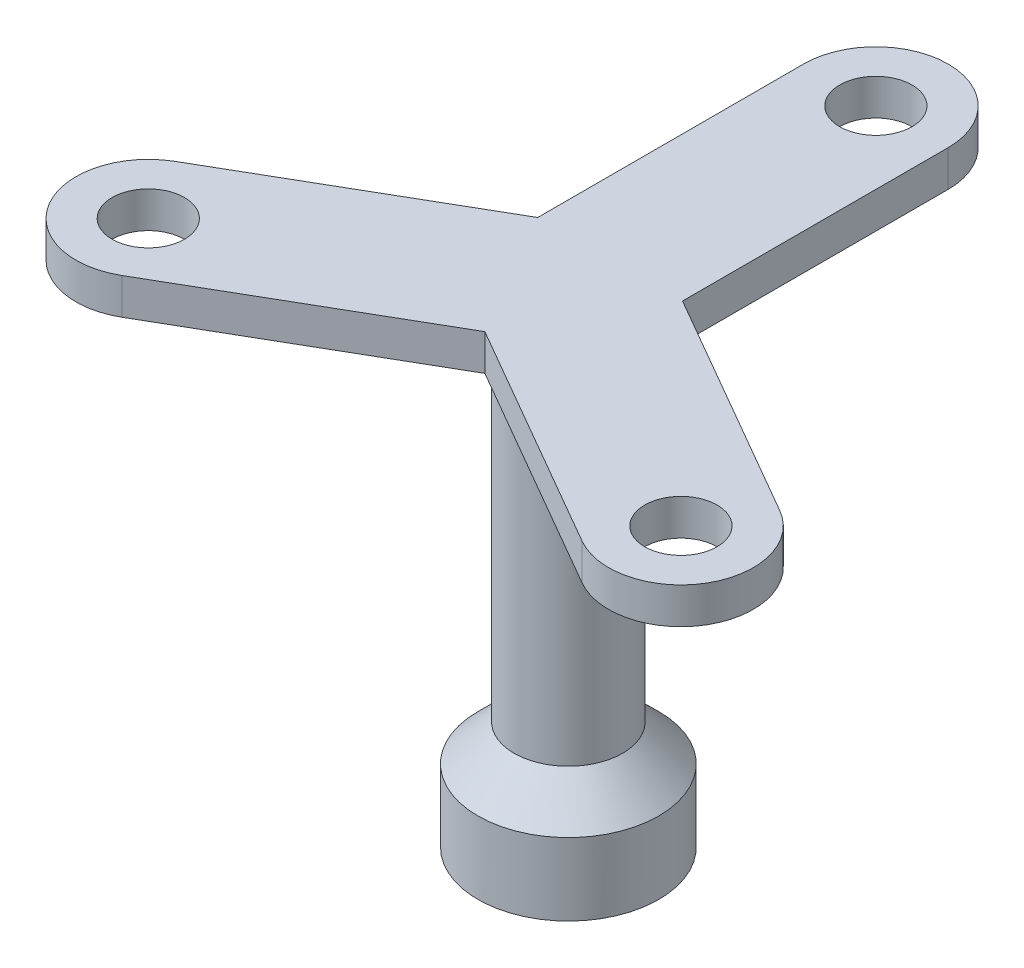
ISO-10303-21;
HEADER;
FILE_DESCRIPTION(('STEP AP214'),'2;1');
FILE_NAME('part.step','',(''),(''),'','','');
FILE_SCHEMA(('AUTOMOTIVE_DESIGN { 1 0 10303 214 1 1 1 1 }'));
ENDSEC;
DATA;
#1=APPLICATION_CONTEXT('core data for automotive mechanical design processes');
#2=APPLICATION_PROTOCOL_DEFINITION('international standard','automotive_design',2000,#1);
#3=PRODUCT_CONTEXT('',#1,'mechanical');
#4=PRODUCT('Part','Part','',(#3));
#5=PRODUCT_RELATED_PRODUCT_CATEGORY('part','',(#4));
#6=PRODUCT_DEFINITION_FORMATION('','',#4);
#7=PRODUCT_DEFINITION_CONTEXT('part definition',#1,'design');
#8=PRODUCT_DEFINITION('design','',#6,#7);
#9=PRODUCT_DEFINITION_SHAPE('','',#8);
#10=(LENGTH_UNIT() NAMED_UNIT(*) SI_UNIT(.MILLI.,.METRE.));
#11=(NAMED_UNIT(*) PLANE_ANGLE_UNIT() SI_UNIT($,.RADIAN.));
#12=(NAMED_UNIT(*) SI_UNIT($,.STERADIAN.) SOLID_ANGLE_UNIT());
#13=UNCERTAINTY_MEASURE_WITH_UNIT(LENGTH_MEASURE(1.E-05),#10,'distance_accuracy_value','');
#14=(GEOMETRIC_REPRESENTATION_CONTEXT(3) GLOBAL_UNCERTAINTY_ASSIGNED_CONTEXT((#13)) GLOBAL_UNIT_ASSIGNED_CONTEXT((#10,
#11,#12)) REPRESENTATION_CONTEXT('',''));
#15=CARTESIAN_POINT('',(0.,0.,0.));
#16=DIRECTION('',(0.,0.,1.));
#17=DIRECTION('',(1.,0.,0.));
#18=AXIS2_PLACEMENT_3D('',#15,#16,#17);
#19=CARTESIAN_POINT('',(0.,-6.99999999999999,0.));
#20=DIRECTION('',(0.,1.,0.));
#21=DIRECTION('',(-1.,0.,0.));
#22=AXIS2_PLACEMENT_3D('',#19,#20,#21);
#23=PLANE('',#22);
#24=CARTESIAN_POINT('',(0.,-7.,0.));
#25=DIRECTION('',(0.,1.,0.));
#26=DIRECTION('',(0.,0.,1.));
#27=AXIS2_PLACEMENT_3D('',#24,#25,#26);
#28=CIRCLE('',#27,3.);
#29=CARTESIAN_POINT('',(0.,-7.,3.));
#30=VERTEX_POINT('',#29);
#31=EDGE_CURVE('E46',#30,#30,#28,.T.);
#32=ORIENTED_EDGE('',*,*,#31,.T.);
#33=EDGE_LOOP('',(#32));
#34=FACE_BOUND('',#33,.T.);
#35=CARTESIAN_POINT('',(0.,-6.99999999999999,0.));
#36=DIRECTION('',(0.,1.,0.));
#37=DIRECTION('',(-1.,0.,0.));
#38=AXIS2_PLACEMENT_3D('',#35,#36,#37);
#39=CIRCLE('',#38,1.);
#40=CARTESIAN_POINT('',(-1.,-6.99999999999999,0.));
#41=VERTEX_POINT('',#40);
#42=EDGE_CURVE('E58',#41,#41,#39,.F.);
#43=ORIENTED_EDGE('',*,*,#42,.T.);
#44=EDGE_LOOP('',(#43));
#45=FACE_BOUND('',#44,.T.);
#46=ADVANCED_FACE('F42',(#34,#45),#23,.T.);
#47=CARTESIAN_POINT('',(0.,-13.,0.));
#48=DIRECTION('',(0.,-1.,0.));
#49=DIRECTION('',(0.,0.,-1.));
#50=AXIS2_PLACEMENT_3D('',#47,#48,#49);
#51=PLANE('',#50);
#52=CARTESIAN_POINT('',(0.,-13.,0.));
#53=DIRECTION('',(0.,-1.,0.));
#54=DIRECTION('',(0.,0.,-1.));
#55=AXIS2_PLACEMENT_3D('',#52,#53,#54);
#56=CIRCLE('',#55,5.);
#57=CARTESIAN_POINT('',(0.,-13.,-5.));
#58=VERTEX_POINT('',#57);
#59=EDGE_CURVE('E55',#58,#58,#56,.T.);
#60=ORIENTED_EDGE('',*,*,#59,.T.);
#61=EDGE_LOOP('',(#60));
#62=FACE_BOUND('',#61,.T.);
#63=CARTESIAN_POINT('',(0.,-13.,0.));
#64=DIRECTION('',(0.,-1.,0.));
#65=DIRECTION('',(0.,0.,-1.));
#66=AXIS2_PLACEMENT_3D('',#63,#64,#65);
#67=CIRCLE('',#66,2.5);
#68=CARTESIAN_POINT('',(0.,-13.,-2.5));
#69=VERTEX_POINT('',#68);
#70=EDGE_CURVE('E50',#69,#69,#67,.T.);
#71=ORIENTED_EDGE('',*,*,#70,.F.);
#72=EDGE_LOOP('',(#71));
#73=FACE_BOUND('',#72,.T.);
#74=ADVANCED_FACE('F83',(#62,#73),#51,.T.);
#75=CARTESIAN_POINT('',(0.,-9.,0.));
#76=DIRECTION('',(0.,-1.,0.));
#77=DIRECTION('',(0.,0.,-1.));
#78=AXIS2_PLACEMENT_3D('',#75,#76,#77);
#79=CYLINDRICAL_SURFACE('',#78,5.);
#80=CARTESIAN_POINT('',(0.,-9.,0.));
#81=DIRECTION('',(0.,1.,0.));
#82=DIRECTION('',(0.,0.,1.));
#83=AXIS2_PLACEMENT_3D('',#80,#81,#82);
#84=CIRCLE('',#83,5.);
#85=CARTESIAN_POINT('',(0.,-9.,5.));
#86=VERTEX_POINT('',#85);
#87=EDGE_CURVE('E64',#86,#86,#84,.T.);
#88=ORIENTED_EDGE('',*,*,#87,.F.);
#89=EDGE_LOOP('',(#88));
#90=FACE_BOUND('',#89,.T.);
#91=ORIENTED_EDGE('',*,*,#59,.F.);
#92=EDGE_LOOP('',(#91));
#93=FACE_BOUND('',#92,.T.);
#94=ADVANCED_FACE('F73',(#90,#93),#79,.T.);
#95=CARTESIAN_POINT('',(0.,-7.,0.));
#96=DIRECTION('',(0.,-1.,0.));
#97=DIRECTION('',(0.,0.,-1.));
#98=AXIS2_PLACEMENT_3D('',#95,#96,#97);
#99=CONICAL_SURFACE('',#98,3.,0.785398163397442);
#100=ORIENTED_EDGE('',*,*,#87,.T.);
#101=EDGE_LOOP('',(#100));
#102=FACE_BOUND('',#101,.T.);
#103=ORIENTED_EDGE('',*,*,#31,.F.);
#104=EDGE_LOOP('',(#103));
#105=FACE_BOUND('',#104,.T.);
#106=ADVANCED_FACE('F70',(#102,#105),#99,.T.);
#107=CARTESIAN_POINT('',(0.,-13.,0.));
#108=DIRECTION('',(0.,1.,0.));
#109=DIRECTION('',(0.,0.,1.));
#110=AXIS2_PLACEMENT_3D('',#107,#108,#109);
#111=CYLINDRICAL_SURFACE('',#110,2.5);
#112=ORIENTED_EDGE('',*,*,#70,.T.);
#113=EDGE_LOOP('',(#112));
#114=FACE_BOUND('',#113,.T.);
#115=CARTESIAN_POINT('',(0.,-10.,0.));
#116=DIRECTION('',(0.,-1.,0.));
#117=DIRECTION('',(0.,0.,-1.));
#118=AXIS2_PLACEMENT_3D('',#115,#116,#117);
#119=CIRCLE('',#118,2.5);
#120=CARTESIAN_POINT('',(0.,-10.,-2.5));
#121=VERTEX_POINT('',#120);
#122=EDGE_CURVE('E60',#121,#121,#119,.F.);
#123=ORIENTED_EDGE('',*,*,#122,.T.);
#124=EDGE_LOOP('',(#123));
#125=FACE_BOUND('',#124,.T.);
#126=ADVANCED_FACE('F72',(#114,#125),#111,.F.);
#127=CARTESIAN_POINT('',(0.,-10.,0.));
#128=DIRECTION('',(0.,-1.,0.));
#129=DIRECTION('',(0.,0.,-1.));
#130=AXIS2_PLACEMENT_3D('',#127,#128,#129);
#131=PLANE('',#130);
#132=CARTESIAN_POINT('',(0.,-10.,0.));
#133=DIRECTION('',(0.,-1.,0.));
#134=DIRECTION('',(0.,0.,-1.));
#135=AXIS2_PLACEMENT_3D('',#132,#133,#134);
#136=CIRCLE('',#135,1.);
#137=CARTESIAN_POINT('',(0.,-10.,-1.));
#138=VERTEX_POINT('',#137);
#139=EDGE_CURVE('E11',#138,#138,#136,.T.);
#140=ORIENTED_EDGE('',*,*,#139,.F.);
#141=EDGE_LOOP('',(#140));
#142=FACE_BOUND('',#141,.T.);
#143=ORIENTED_EDGE('',*,*,#122,.F.);
#144=EDGE_LOOP('',(#143));
#145=FACE_BOUND('',#144,.T.);
#146=ADVANCED_FACE('F80',(#142,#145),#131,.T.);
#147=CARTESIAN_POINT('',(0.,-2.,0.));
#148=DIRECTION('',(0.,-1.,0.));
#149=DIRECTION('',(0.,0.,-1.));
#150=AXIS2_PLACEMENT_3D('',#147,#148,#149);
#151=CYLINDRICAL_SURFACE('',#150,1.);
#152=ORIENTED_EDGE('',*,*,#139,.T.);
#153=EDGE_LOOP('',(#152));
#154=FACE_BOUND('',#153,.T.);
#155=ORIENTED_EDGE('',*,*,#42,.F.);
#156=EDGE_LOOP('',(#155));
#157=FACE_BOUND('',#156,.T.);
#158=ADVANCED_FACE('F44',(#154,#157),#151,.F.);
#159=CLOSED_SHELL('',(#46,#74,#94,#106,#126,#146,#158));
#160=MANIFOLD_SOLID_BREP('B2',#159);
#161=CARTESIAN_POINT('',(0.,-6.99999999999999,0.));
#162=DIRECTION('',(0.,1.,0.));
#163=DIRECTION('',(-1.,0.,0.));
#164=AXIS2_PLACEMENT_3D('',#161,#162,#163);
#165=PLANE('',#164);
#166=CARTESIAN_POINT('',(0.,-6.99999999999999,0.));
#167=DIRECTION('',(0.,1.,0.));
#168=DIRECTION('',(-1.,0.,0.));
#169=AXIS2_PLACEMENT_3D('',#166,#167,#168);
#170=CIRCLE('',#169,1.);
#171=CARTESIAN_POINT('',(-1.,-6.99999999999999,0.));
#172=VERTEX_POINT('',#171);
#173=EDGE_CURVE('E40',#172,#172,#170,.F.);
#174=ORIENTED_EDGE('',*,*,#173,.F.);
#175=EDGE_LOOP('',(#174));
#176=FACE_BOUND('',#175,.T.);
#177=CARTESIAN_POINT('',(0.,-7.,0.));
#178=DIRECTION('',(0.,1.,0.));
#179=DIRECTION('',(0.,0.,1.));
#180=AXIS2_PLACEMENT_3D('',#177,#178,#179);
#181=CIRCLE('',#180,3.);
#182=CARTESIAN_POINT('',(0.,-7.,3.));
#183=VERTEX_POINT('',#182);
#184=EDGE_CURVE('E162',#183,#183,#181,.T.);
#185=ORIENTED_EDGE('',*,*,#184,.F.);
#186=EDGE_LOOP('',(#185));
#187=FACE_BOUND('',#186,.T.);
#188=ADVANCED_FACE('F154',(#176,#187),#165,.F.);
#189=CARTESIAN_POINT('',(0.,-2.,0.));
#190=DIRECTION('',(0.,-1.,0.));
#191=DIRECTION('',(0.,0.,-1.));
#192=AXIS2_PLACEMENT_3D('',#189,#190,#191);
#193=PLANE('',#192);
#194=CARTESIAN_POINT('',(0.,-2.,0.));
#195=DIRECTION('',(0.,-1.,0.));
#196=DIRECTION('',(0.,0.,-1.));
#197=AXIS2_PLACEMENT_3D('',#194,#195,#196);
#198=CIRCLE('',#197,1.);
#199=CARTESIAN_POINT('',(0.,-2.,-1.));
#200=VERTEX_POINT('',#199);
#201=EDGE_CURVE('E270',#200,#200,#198,.T.);
#202=ORIENTED_EDGE('',*,*,#201,.T.);
#203=EDGE_LOOP('',(#202));
#204=FACE_BOUND('',#203,.T.);
#205=ADVANCED_FACE('F320',(#204),#193,.T.);
#206=CARTESIAN_POINT('',(0.,-2.,0.));
#207=DIRECTION('',(0.,-1.,0.));
#208=DIRECTION('',(0.,0.,-1.));
#209=AXIS2_PLACEMENT_3D('',#206,#207,#208);
#210=CYLINDRICAL_SURFACE('',#209,1.);
#211=ORIENTED_EDGE('',*,*,#173,.T.);
#212=EDGE_LOOP('',(#211));
#213=FACE_BOUND('',#212,.T.);
#214=ORIENTED_EDGE('',*,*,#201,.F.);
#215=EDGE_LOOP('',(#214));
#216=FACE_BOUND('',#215,.T.);
#217=ADVANCED_FACE('F325',(#213,#216),#210,.F.);
#218=CARTESIAN_POINT('',(-4.,14.,0.));
#219=DIRECTION('',(-1.,0.,0.));
#220=DIRECTION('',(0.,0.,1.));
#221=AXIS2_PLACEMENT_3D('',#218,#219,#220);
#222=PLANE('',#221);
#223=DIRECTION('',(0.,0.,-1.));
#224=VECTOR('',#223,1.);
#225=CARTESIAN_POINT('',(-4.,12.,0.));
#226=LINE('',#225,#224);
#227=CARTESIAN_POINT('',(-4.,12.,-2.30766902595093));
#228=VERTEX_POINT('',#227);
#229=CARTESIAN_POINT('',(-4.,12.,-17.));
#230=VERTEX_POINT('',#229);
#231=EDGE_CURVE('E266',#228,#230,#226,.T.);
#232=ORIENTED_EDGE('',*,*,#231,.F.);
#233=DIRECTION('',(0.,-1.,0.));
#234=VECTOR('',#233,1.);
#235=CARTESIAN_POINT('',(-4.,14.,-2.30766902595093));
#236=LINE('',#235,#234);
#237=CARTESIAN_POINT('',(-4.,14.,-2.30766902595093));
#238=VERTEX_POINT('',#237);
#239=EDGE_CURVE('E213',#238,#228,#236,.T.);
#240=ORIENTED_EDGE('',*,*,#239,.F.);
#241=DIRECTION('',(0.,0.,-1.));
#242=VECTOR('',#241,1.);
#243=CARTESIAN_POINT('',(-4.,14.,0.));
#244=LINE('',#243,#242);
#245=CARTESIAN_POINT('',(-4.,14.,-17.));
#246=VERTEX_POINT('',#245);
#247=EDGE_CURVE('E296',#238,#246,#244,.T.);
#248=ORIENTED_EDGE('',*,*,#247,.T.);
#249=DIRECTION('',(0.,-1.,0.));
#250=VECTOR('',#249,1.);
#251=CARTESIAN_POINT('',(-4.,14.,-17.));
#252=LINE('',#251,#250);
#253=EDGE_CURVE('E208',#246,#230,#252,.T.);
#254=ORIENTED_EDGE('',*,*,#253,.T.);
#255=EDGE_LOOP('',(#232,#240,#248,#254));
#256=FACE_BOUND('',#255,.T.);
#257=ADVANCED_FACE('F379',(#256),#222,.T.);
#258=CARTESIAN_POINT('',(-1.99925,14.,-3.46280257703208));
#259=DIRECTION('',(0.5,0.,0.866025403784439));
#260=DIRECTION('',(0.866025403784439,0.,-0.5));
#261=AXIS2_PLACEMENT_3D('',#258,#259,#260);
#262=PLANE('',#261);
#263=DIRECTION('',(-0.866025403784439,0.,0.5));
#264=VECTOR('',#263,1.);
#265=CARTESIAN_POINT('',(-1.99925,12.,-3.46280257703208));
#266=LINE('',#265,#264);
#267=CARTESIAN_POINT('',(-16.7209318643355,12.,5.03676441026603));
#268=VERTEX_POINT('',#267);
#269=EDGE_CURVE('E269',#228,#268,#266,.T.);
#270=ORIENTED_EDGE('',*,*,#269,.T.);
#271=DIRECTION('',(0.,-1.,0.));
#272=VECTOR('',#271,1.);
#273=CARTESIAN_POINT('',(-16.7209318643355,14.,5.03676441026603));
#274=LINE('',#273,#272);
#275=CARTESIAN_POINT('',(-16.7209318643355,14.,5.03676441026603));
#276=VERTEX_POINT('',#275);
#277=EDGE_CURVE('E307',#276,#268,#274,.T.);
#278=ORIENTED_EDGE('',*,*,#277,.F.);
#279=DIRECTION('',(-0.866025403784439,0.,0.5));
#280=VECTOR('',#279,1.);
#281=CARTESIAN_POINT('',(-1.99925,14.,-3.46280257703208));
#282=LINE('',#281,#280);
#283=EDGE_CURVE('E398',#238,#276,#282,.T.);
#284=ORIENTED_EDGE('',*,*,#283,.F.);
#285=ORIENTED_EDGE('',*,*,#239,.T.);
#286=EDGE_LOOP('',(#270,#278,#284,#285));
#287=FACE_BOUND('',#286,.T.);
#288=ADVANCED_FACE('F376',(#287),#262,.F.);
#289=CARTESIAN_POINT('',(-14.7209318643355,14.,8.50086602540365));
#290=DIRECTION('',(0.,-1.,0.));
#291=DIRECTION('',(0.,0.,-1.));
#292=AXIS2_PLACEMENT_3D('',#289,#290,#291);
#293=CYLINDRICAL_SURFACE('',#292,4.);
#294=CARTESIAN_POINT('',(-14.7209318643355,12.,8.50086602540365));
#295=DIRECTION('',(0.,1.,0.));
#296=DIRECTION('',(0.,0.,1.));
#297=AXIS2_PLACEMENT_3D('',#294,#295,#296);
#298=CIRCLE('',#297,4.);
#299=CARTESIAN_POINT('',(-12.7209318643355,12.,11.9649676405415));
#300=VERTEX_POINT('',#299);
#301=EDGE_CURVE('E272',#268,#300,#298,.T.);
#302=ORIENTED_EDGE('',*,*,#301,.T.);
#303=DIRECTION('',(0.,-1.,0.));
#304=VECTOR('',#303,1.);
#305=CARTESIAN_POINT('',(-12.7209318643355,14.,11.9649676405415));
#306=LINE('',#305,#304);
#307=CARTESIAN_POINT('',(-12.7209318643355,14.,11.9649676405415));
#308=VERTEX_POINT('',#307);
#309=EDGE_CURVE('E305',#308,#300,#306,.T.);
#310=ORIENTED_EDGE('',*,*,#309,.F.);
#311=CARTESIAN_POINT('',(-14.7209318643355,14.,8.50086602540365));
#312=DIRECTION('',(0.,1.,0.));
#313=DIRECTION('',(0.,0.,1.));
#314=AXIS2_PLACEMENT_3D('',#311,#312,#313);
#315=CIRCLE('',#314,4.);
#316=EDGE_CURVE('E394',#276,#308,#315,.T.);
#317=ORIENTED_EDGE('',*,*,#316,.F.);
#318=ORIENTED_EDGE('',*,*,#277,.T.);
#319=EDGE_LOOP('',(#302,#310,#317,#318));
#320=FACE_BOUND('',#319,.T.);
#321=ADVANCED_FACE('F372',(#320),#293,.T.);
#322=CARTESIAN_POINT('',(2.00075,14.,3.46540065324343));
#323=DIRECTION('',(0.5,0.,0.866025403784439));
#324=DIRECTION('',(0.866025403784439,0.,-0.5));
#325=AXIS2_PLACEMENT_3D('',#322,#323,#324);
#326=PLANE('',#325);
#327=DIRECTION('',(-0.866025403784439,0.,0.5));
#328=VECTOR('',#327,1.);
#329=CARTESIAN_POINT('',(2.00075,12.,3.46540065324343));
#330=LINE('',#329,#328);
#331=CARTESIAN_POINT('',(0.00299999999999736,12.,4.618802153517));
#332=VERTEX_POINT('',#331);
#333=EDGE_CURVE('E275',#332,#300,#330,.T.);
#334=ORIENTED_EDGE('',*,*,#333,.F.);
#335=DIRECTION('',(0.,-1.,0.));
#336=VECTOR('',#335,1.);
#337=CARTESIAN_POINT('',(0.00299999999999736,14.,4.618802153517));
#338=LINE('',#337,#336);
#339=CARTESIAN_POINT('',(0.00299999999999736,14.,4.618802153517));
#340=VERTEX_POINT('',#339);
#341=EDGE_CURVE('E303',#340,#332,#338,.T.);
#342=ORIENTED_EDGE('',*,*,#341,.F.);
#343=DIRECTION('',(-0.866025403784439,0.,0.5));
#344=VECTOR('',#343,1.);
#345=CARTESIAN_POINT('',(2.00075,14.,3.46540065324343));
#346=LINE('',#345,#344);
#347=EDGE_CURVE('E397',#340,#308,#346,.T.);
#348=ORIENTED_EDGE('',*,*,#347,.T.);
#349=ORIENTED_EDGE('',*,*,#309,.T.);
#350=EDGE_LOOP('',(#334,#342,#348,#349));
#351=FACE_BOUND('',#350,.T.);
#352=ADVANCED_FACE('F368',(#351),#326,.T.);
#353=CARTESIAN_POINT('',(-1.99925,14.,3.46280257703208));
#354=DIRECTION('',(0.5,0.,-0.866025403784439));
#355=DIRECTION('',(-0.866025403784439,0.,-0.5));
#356=AXIS2_PLACEMENT_3D('',#353,#354,#355);
#357=PLANE('',#356);
#358=DIRECTION('',(0.866025403784439,0.,0.5));
#359=VECTOR('',#358,1.);
#360=CARTESIAN_POINT('',(-1.99925,12.,3.46280257703208));
#361=LINE('',#360,#359);
#362=CARTESIAN_POINT('',(12.7239318643355,12.,11.963235589734));
#363=VERTEX_POINT('',#362);
#364=EDGE_CURVE('E278',#332,#363,#361,.T.);
#365=ORIENTED_EDGE('',*,*,#364,.T.);
#366=DIRECTION('',(0.,-1.,0.));
#367=VECTOR('',#366,1.);
#368=CARTESIAN_POINT('',(12.7239318643355,14.,11.963235589734));
#369=LINE('',#368,#367);
#370=CARTESIAN_POINT('',(12.7239318643355,14.,11.963235589734));
#371=VERTEX_POINT('',#370);
#372=EDGE_CURVE('E300',#371,#363,#369,.T.);
#373=ORIENTED_EDGE('',*,*,#372,.F.);
#374=DIRECTION('',(0.866025403784439,0.,0.5));
#375=VECTOR('',#374,1.);
#376=CARTESIAN_POINT('',(-1.99925,14.,3.46280257703208));
#377=LINE('',#376,#375);
#378=EDGE_CURVE('E252',#340,#371,#377,.T.);
#379=ORIENTED_EDGE('',*,*,#378,.F.);
#380=ORIENTED_EDGE('',*,*,#341,.T.);
#381=EDGE_LOOP('',(#365,#373,#379,#380));
#382=FACE_BOUND('',#381,.T.);
#383=ADVANCED_FACE('F364',(#382),#357,.F.);
#384=CARTESIAN_POINT('',(14.7239318643354,14.,8.49913397459629));
#385=DIRECTION('',(0.,-1.,0.));
#386=DIRECTION('',(0.,0.,-1.));
#387=AXIS2_PLACEMENT_3D('',#384,#385,#386);
#388=CYLINDRICAL_SURFACE('',#387,4.);
#389=CARTESIAN_POINT('',(14.7239318643354,12.,8.49913397459629));
#390=DIRECTION('',(0.,1.,0.));
#391=DIRECTION('',(0.,0.,1.));
#392=AXIS2_PLACEMENT_3D('',#389,#390,#391);
#393=CIRCLE('',#392,4.);
#394=CARTESIAN_POINT('',(16.7239318643355,12.,5.03503235945846));
#395=VERTEX_POINT('',#394);
#396=EDGE_CURVE('E280',#363,#395,#393,.T.);
#397=ORIENTED_EDGE('',*,*,#396,.T.);
#398=DIRECTION('',(0.,-1.,0.));
#399=VECTOR('',#398,1.);
#400=CARTESIAN_POINT('',(16.7239318643355,14.,5.03503235945846));
#401=LINE('',#400,#399);
#402=CARTESIAN_POINT('',(16.7239318643355,14.,5.03503235945846));
#403=VERTEX_POINT('',#402);
#404=EDGE_CURVE('E240',#403,#395,#401,.T.);
#405=ORIENTED_EDGE('',*,*,#404,.F.);
#406=CARTESIAN_POINT('',(14.7239318643354,14.,8.49913397459629));
#407=DIRECTION('',(0.,1.,0.));
#408=DIRECTION('',(0.,0.,1.));
#409=AXIS2_PLACEMENT_3D('',#406,#407,#408);
#410=CIRCLE('',#409,4.);
#411=EDGE_CURVE('E249',#371,#403,#410,.T.);
#412=ORIENTED_EDGE('',*,*,#411,.F.);
#413=ORIENTED_EDGE('',*,*,#372,.T.);
#414=EDGE_LOOP('',(#397,#405,#412,#413));
#415=FACE_BOUND('',#414,.T.);
#416=ADVANCED_FACE('F361',(#415),#388,.T.);
#417=CARTESIAN_POINT('',(2.00075,14.,-3.46540065324343));
#418=DIRECTION('',(0.5,0.,-0.866025403784439));
#419=DIRECTION('',(-0.866025403784439,0.,-0.5));
#420=AXIS2_PLACEMENT_3D('',#417,#418,#419);
#421=PLANE('',#420);
#422=DIRECTION('',(0.866025403784439,0.,0.5));
#423=VECTOR('',#422,1.);
#424=CARTESIAN_POINT('',(2.00075,12.,-3.46540065324343));
#425=LINE('',#424,#423);
#426=CARTESIAN_POINT('',(4.,12.,-2.31113312756607));
#427=VERTEX_POINT('',#426);
#428=EDGE_CURVE('E239',#427,#395,#425,.T.);
#429=ORIENTED_EDGE('',*,*,#428,.F.);
#430=DIRECTION('',(0.,-1.,0.));
#431=VECTOR('',#430,1.);
#432=CARTESIAN_POINT('',(4.,14.,-2.31113312756607));
#433=LINE('',#432,#431);
#434=CARTESIAN_POINT('',(4.,14.,-2.31113312756607));
#435=VERTEX_POINT('',#434);
#436=EDGE_CURVE('E233',#435,#427,#433,.T.);
#437=ORIENTED_EDGE('',*,*,#436,.F.);
#438=DIRECTION('',(0.866025403784439,0.,0.5));
#439=VECTOR('',#438,1.);
#440=CARTESIAN_POINT('',(2.00075,14.,-3.46540065324343));
#441=LINE('',#440,#439);
#442=EDGE_CURVE('E237',#435,#403,#441,.T.);
#443=ORIENTED_EDGE('',*,*,#442,.T.);
#444=ORIENTED_EDGE('',*,*,#404,.T.);
#445=EDGE_LOOP('',(#429,#437,#443,#444));
#446=FACE_BOUND('',#445,.T.);
#447=ADVANCED_FACE('F235',(#446),#421,.T.);
#448=CARTESIAN_POINT('',(4.,14.,0.));
#449=DIRECTION('',(-1.,0.,0.));
#450=DIRECTION('',(0.,0.,1.));
#451=AXIS2_PLACEMENT_3D('',#448,#449,#450);
#452=PLANE('',#451);
#453=DIRECTION('',(0.,0.,-1.));
#454=VECTOR('',#453,1.);
#455=CARTESIAN_POINT('',(4.,12.,0.));
#456=LINE('',#455,#454);
#457=CARTESIAN_POINT('',(4.,12.,-17.));
#458=VERTEX_POINT('',#457);
#459=EDGE_CURVE('E201',#427,#458,#456,.T.);
#460=ORIENTED_EDGE('',*,*,#459,.T.);
#461=DIRECTION('',(0.,-1.,0.));
#462=VECTOR('',#461,1.);
#463=CARTESIAN_POINT('',(4.,14.,-17.));
#464=LINE('',#463,#462);
#465=CARTESIAN_POINT('',(4.,14.,-17.));
#466=VERTEX_POINT('',#465);
#467=EDGE_CURVE('E241',#466,#458,#464,.T.);
#468=ORIENTED_EDGE('',*,*,#467,.F.);
#469=DIRECTION('',(0.,0.,-1.));
#470=VECTOR('',#469,1.);
#471=CARTESIAN_POINT('',(4.,14.,0.));
#472=LINE('',#471,#470);
#473=EDGE_CURVE('E243',#435,#466,#472,.T.);
#474=ORIENTED_EDGE('',*,*,#473,.F.);
#475=ORIENTED_EDGE('',*,*,#436,.T.);
#476=EDGE_LOOP('',(#460,#468,#474,#475));
#477=FACE_BOUND('',#476,.T.);
#478=ADVANCED_FACE('F244',(#477),#452,.F.);
#479=CARTESIAN_POINT('',(14.7224318643354,14.,8.50000000000007));
#480=DIRECTION('',(0.,-1.,0.));
#481=DIRECTION('',(0.,0.,-1.));
#482=AXIS2_PLACEMENT_3D('',#479,#480,#481);
#483=CYLINDRICAL_SURFACE('',#482,2.00000000000001);
#484=CARTESIAN_POINT('',(14.7224318643354,14.,8.50000000000007));
#485=DIRECTION('',(0.,1.,0.));
#486=DIRECTION('',(0.,0.,1.));
#487=AXIS2_PLACEMENT_3D('',#484,#485,#486);
#488=CIRCLE('',#487,2.00000000000001);
#489=CARTESIAN_POINT('',(14.7224318643354,14.,10.5000000000001));
#490=VERTEX_POINT('',#489);
#491=EDGE_CURVE('E260',#490,#490,#488,.T.);
#492=ORIENTED_EDGE('',*,*,#491,.T.);
#493=EDGE_LOOP('',(#492));
#494=FACE_BOUND('',#493,.T.);
#495=CARTESIAN_POINT('',(14.7224318643354,12.,8.50000000000007));
#496=DIRECTION('',(0.,1.,0.));
#497=DIRECTION('',(0.,0.,1.));
#498=AXIS2_PLACEMENT_3D('',#495,#496,#497);
#499=CIRCLE('',#498,2.00000000000001);
#500=CARTESIAN_POINT('',(14.7224318643354,12.,10.5000000000001));
#501=VERTEX_POINT('',#500);
#502=EDGE_CURVE('E290',#501,#501,#499,.T.);
#503=ORIENTED_EDGE('',*,*,#502,.F.);
#504=EDGE_LOOP('',(#503));
#505=FACE_BOUND('',#504,.T.);
#506=ADVANCED_FACE('F346',(#494,#505),#483,.F.);
#507=CARTESIAN_POINT('',(0.,14.,-17.));
#508=DIRECTION('',(0.,-1.,0.));
#509=DIRECTION('',(0.,0.,-1.));
#510=AXIS2_PLACEMENT_3D('',#507,#508,#509);
#511=CYLINDRICAL_SURFACE('',#510,2.);
#512=CARTESIAN_POINT('',(0.,14.,-17.));
#513=DIRECTION('',(0.,1.,0.));
#514=DIRECTION('',(0.,0.,1.));
#515=AXIS2_PLACEMENT_3D('',#512,#513,#514);
#516=CIRCLE('',#515,2.);
#517=CARTESIAN_POINT('',(0.,14.,-15.));
#518=VERTEX_POINT('',#517);
#519=EDGE_CURVE('E257',#518,#518,#516,.T.);
#520=ORIENTED_EDGE('',*,*,#519,.T.);
#521=EDGE_LOOP('',(#520));
#522=FACE_BOUND('',#521,.T.);
#523=CARTESIAN_POINT('',(0.,12.,-17.));
#524=DIRECTION('',(0.,1.,0.));
#525=DIRECTION('',(0.,0.,1.));
#526=AXIS2_PLACEMENT_3D('',#523,#524,#525);
#527=CIRCLE('',#526,2.);
#528=CARTESIAN_POINT('',(0.,12.,-15.));
#529=VERTEX_POINT('',#528);
#530=EDGE_CURVE('E287',#529,#529,#527,.T.);
#531=ORIENTED_EDGE('',*,*,#530,.F.);
#532=EDGE_LOOP('',(#531));
#533=FACE_BOUND('',#532,.T.);
#534=ADVANCED_FACE('F349',(#522,#533),#511,.F.);
#535=CARTESIAN_POINT('',(0.,14.,-17.));
#536=DIRECTION('',(0.,-1.,0.));
#537=DIRECTION('',(0.,0.,-1.));
#538=AXIS2_PLACEMENT_3D('',#535,#536,#537);
#539=CYLINDRICAL_SURFACE('',#538,4.);
#540=CARTESIAN_POINT('',(0.,12.,-17.));
#541=DIRECTION('',(0.,1.,0.));
#542=DIRECTION('',(0.,0.,1.));
#543=AXIS2_PLACEMENT_3D('',#540,#541,#542);
#544=CIRCLE('',#543,4.);
#545=EDGE_CURVE('E285',#458,#230,#544,.T.);
#546=ORIENTED_EDGE('',*,*,#545,.T.);
#547=ORIENTED_EDGE('',*,*,#253,.F.);
#548=CARTESIAN_POINT('',(0.,14.,-17.));
#549=DIRECTION('',(0.,1.,0.));
#550=DIRECTION('',(0.,0.,1.));
#551=AXIS2_PLACEMENT_3D('',#548,#549,#550);
#552=CIRCLE('',#551,4.);
#553=EDGE_CURVE('E170',#466,#246,#552,.T.);
#554=ORIENTED_EDGE('',*,*,#553,.F.);
#555=ORIENTED_EDGE('',*,*,#467,.T.);
#556=EDGE_LOOP('',(#546,#547,#554,#555));
#557=FACE_BOUND('',#556,.T.);
#558=ADVANCED_FACE('F344',(#557),#539,.T.);
#559=CARTESIAN_POINT('',(-14.7224318643354,14.,8.50000000000007));
#560=DIRECTION('',(0.,-1.,0.));
#561=DIRECTION('',(0.,0.,-1.));
#562=AXIS2_PLACEMENT_3D('',#559,#560,#561);
#563=CYLINDRICAL_SURFACE('',#562,2.);
#564=CARTESIAN_POINT('',(-14.7224318643354,14.,8.50000000000007));
#565=DIRECTION('',(0.,1.,0.));
#566=DIRECTION('',(0.,0.,1.));
#567=AXIS2_PLACEMENT_3D('',#564,#565,#566);
#568=CIRCLE('',#567,2.);
#569=CARTESIAN_POINT('',(-14.7224318643354,14.,10.5000000000001));
#570=VERTEX_POINT('',#569);
#571=EDGE_CURVE('E263',#570,#570,#568,.T.);
#572=ORIENTED_EDGE('',*,*,#571,.T.);
#573=EDGE_LOOP('',(#572));
#574=FACE_BOUND('',#573,.T.);
#575=CARTESIAN_POINT('',(-14.7224318643354,12.,8.50000000000007));
#576=DIRECTION('',(0.,1.,0.));
#577=DIRECTION('',(0.,0.,1.));
#578=AXIS2_PLACEMENT_3D('',#575,#576,#577);
#579=CIRCLE('',#578,2.);
#580=CARTESIAN_POINT('',(-14.7224318643354,12.,10.5000000000001));
#581=VERTEX_POINT('',#580);
#582=EDGE_CURVE('E293',#581,#581,#579,.T.);
#583=ORIENTED_EDGE('',*,*,#582,.F.);
#584=EDGE_LOOP('',(#583));
#585=FACE_BOUND('',#584,.T.);
#586=ADVANCED_FACE('F340',(#574,#585),#563,.F.);
#587=CARTESIAN_POINT('',(0.,14.,0.));
#588=DIRECTION('',(0.,1.,0.));
#589=DIRECTION('',(0.,0.,1.));
#590=AXIS2_PLACEMENT_3D('',#587,#588,#589);
#591=PLANE('',#590);
#592=ORIENTED_EDGE('',*,*,#247,.F.);
#593=ORIENTED_EDGE('',*,*,#283,.T.);
#594=ORIENTED_EDGE('',*,*,#316,.T.);
#595=ORIENTED_EDGE('',*,*,#347,.F.);
#596=ORIENTED_EDGE('',*,*,#378,.T.);
#597=ORIENTED_EDGE('',*,*,#411,.T.);
#598=ORIENTED_EDGE('',*,*,#442,.F.);
#599=ORIENTED_EDGE('',*,*,#473,.T.);
#600=ORIENTED_EDGE('',*,*,#553,.T.);
#601=EDGE_LOOP('',(#592,#593,#594,#595,#596,#597,#598,#599,#600));
#602=FACE_BOUND('',#601,.T.);
#603=ORIENTED_EDGE('',*,*,#519,.F.);
#604=EDGE_LOOP('',(#603));
#605=FACE_BOUND('',#604,.T.);
#606=ORIENTED_EDGE('',*,*,#491,.F.);
#607=EDGE_LOOP('',(#606));
#608=FACE_BOUND('',#607,.T.);
#609=ORIENTED_EDGE('',*,*,#571,.F.);
#610=EDGE_LOOP('',(#609));
#611=FACE_BOUND('',#610,.T.);
#612=ADVANCED_FACE('F246',(#602,#605,#608,#611),#591,.T.);
#613=CARTESIAN_POINT('',(0.,12.,0.));
#614=DIRECTION('',(0.,1.,0.));
#615=DIRECTION('',(0.,0.,1.));
#616=AXIS2_PLACEMENT_3D('',#613,#614,#615);
#617=PLANE('',#616);
#618=CARTESIAN_POINT('',(0.,12.,0.));
#619=DIRECTION('',(0.,1.,0.));
#620=DIRECTION('',(0.,0.,1.));
#621=AXIS2_PLACEMENT_3D('',#618,#619,#620);
#622=CIRCLE('',#621,3.);
#623=CARTESIAN_POINT('',(0.,12.,3.));
#624=VERTEX_POINT('',#623);
#625=EDGE_CURVE('E311',#624,#624,#622,.F.);
#626=ORIENTED_EDGE('',*,*,#625,.F.);
#627=EDGE_LOOP('',(#626));
#628=FACE_BOUND('',#627,.T.);
#629=ORIENTED_EDGE('',*,*,#231,.T.);
#630=ORIENTED_EDGE('',*,*,#545,.F.);
#631=ORIENTED_EDGE('',*,*,#459,.F.);
#632=ORIENTED_EDGE('',*,*,#428,.T.);
#633=ORIENTED_EDGE('',*,*,#396,.F.);
#634=ORIENTED_EDGE('',*,*,#364,.F.);
#635=ORIENTED_EDGE('',*,*,#333,.T.);
#636=ORIENTED_EDGE('',*,*,#301,.F.);
#637=ORIENTED_EDGE('',*,*,#269,.F.);
#638=EDGE_LOOP('',(#629,#630,#631,#632,#633,#634,#635,#636,#637));
#639=FACE_BOUND('',#638,.T.);
#640=ORIENTED_EDGE('',*,*,#530,.T.);
#641=EDGE_LOOP('',(#640));
#642=FACE_BOUND('',#641,.T.);
#643=ORIENTED_EDGE('',*,*,#502,.T.);
#644=EDGE_LOOP('',(#643));
#645=FACE_BOUND('',#644,.T.);
#646=ORIENTED_EDGE('',*,*,#582,.T.);
#647=EDGE_LOOP('',(#646));
#648=FACE_BOUND('',#647,.T.);
#649=ADVANCED_FACE('F330',(#628,#639,#642,#645,#648),#617,.F.);
#650=CARTESIAN_POINT('',(0.,-10.,0.));
#651=DIRECTION('',(0.,1.,0.));
#652=DIRECTION('',(0.,0.,1.));
#653=AXIS2_PLACEMENT_3D('',#650,#651,#652);
#654=CYLINDRICAL_SURFACE('',#653,3.);
#655=ORIENTED_EDGE('',*,*,#184,.T.);
#656=EDGE_LOOP('',(#655));
#657=FACE_BOUND('',#656,.T.);
#658=ORIENTED_EDGE('',*,*,#625,.T.);
#659=EDGE_LOOP('',(#658));
#660=FACE_BOUND('',#659,.T.);
#661=ADVANCED_FACE('F316',(#657,#660),#654,.T.);
#662=CLOSED_SHELL('',(#188,#205,#217,#257,#288,#321,#352,#383,#416,#447,#478,#506,#534,#558,
#586,#612,#649,#661));
#663=MANIFOLD_SOLID_BREP('B6',#662);
#664=ADVANCED_BREP_SHAPE_REPRESENTATION('',(#18,#160,#663),#14);
#665=SHAPE_DEFINITION_REPRESENTATION(#9,#664);
ENDSEC;
END-ISO-10303-21;
